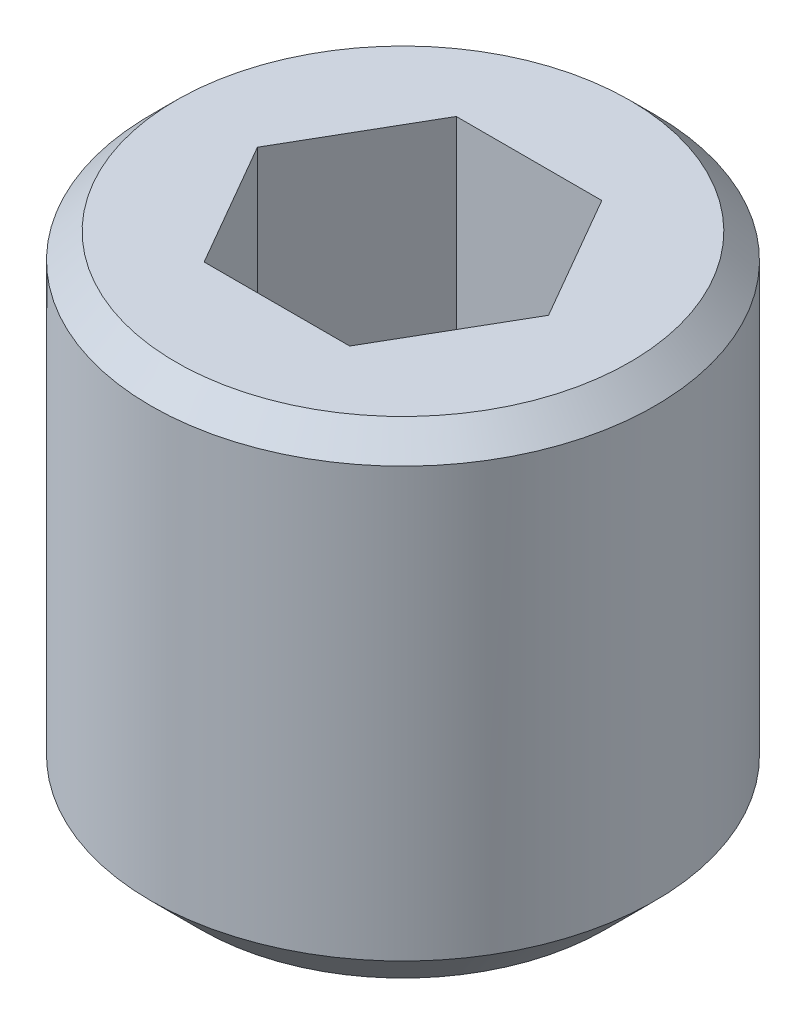
ISO-10303-21;
HEADER;
FILE_DESCRIPTION(('STEP AP214'),'2;1');
FILE_NAME('part.step','',(''),(''),'','','');
FILE_SCHEMA(('AUTOMOTIVE_DESIGN { 1 0 10303 214 1 1 1 1 }'));
ENDSEC;
DATA;
#1=APPLICATION_CONTEXT('core data for automotive mechanical design processes');
#2=APPLICATION_PROTOCOL_DEFINITION('international standard','automotive_design',2000,#1);
#3=PRODUCT_CONTEXT('',#1,'mechanical');
#4=PRODUCT('Part','Part','',(#3));
#5=PRODUCT_RELATED_PRODUCT_CATEGORY('part','',(#4));
#6=PRODUCT_DEFINITION_FORMATION('','',#4);
#7=PRODUCT_DEFINITION_CONTEXT('part definition',#1,'design');
#8=PRODUCT_DEFINITION('design','',#6,#7);
#9=PRODUCT_DEFINITION_SHAPE('','',#8);
#10=(LENGTH_UNIT() NAMED_UNIT(*) SI_UNIT(.MILLI.,.METRE.));
#11=(NAMED_UNIT(*) PLANE_ANGLE_UNIT() SI_UNIT($,.RADIAN.));
#12=(NAMED_UNIT(*) SI_UNIT($,.STERADIAN.) SOLID_ANGLE_UNIT());
#13=UNCERTAINTY_MEASURE_WITH_UNIT(LENGTH_MEASURE(1.E-05),#10,'distance_accuracy_value','');
#14=(GEOMETRIC_REPRESENTATION_CONTEXT(3) GLOBAL_UNCERTAINTY_ASSIGNED_CONTEXT((#13)) GLOBAL_UNIT_ASSIGNED_CONTEXT((#10,
#11,#12)) REPRESENTATION_CONTEXT('',''));
#15=CARTESIAN_POINT('',(0.,0.,0.));
#16=DIRECTION('',(0.,0.,1.));
#17=DIRECTION('',(1.,0.,0.));
#18=AXIS2_PLACEMENT_3D('',#15,#16,#17);
#19=CARTESIAN_POINT('',(0.,0.,0.));
#20=DIRECTION('',(0.,-1.,0.));
#21=DIRECTION('',(0.,0.,-1.));
#22=AXIS2_PLACEMENT_3D('',#19,#20,#21);
#23=PLANE('',#22);
#24=CARTESIAN_POINT('',(0.,0.,0.));
#25=DIRECTION('',(0.,-1.,0.));
#26=DIRECTION('',(0.,0.,-1.));
#27=AXIS2_PLACEMENT_3D('',#24,#25,#26);
#28=CIRCLE('',#27,1.35);
#29=CARTESIAN_POINT('',(0.,0.,-1.35));
#30=VERTEX_POINT('',#29);
#31=EDGE_CURVE('E46',#30,#30,#28,.F.);
#32=ORIENTED_EDGE('',*,*,#31,.T.);
#33=EDGE_LOOP('',(#32));
#34=FACE_BOUND('',#33,.T.);
#35=DIRECTION('',(-0.5,0.,0.866025403784439));
#36=VECTOR('',#35,1.);
#37=CARTESIAN_POINT('',(-0.43301270189222,0.,-0.75));
#38=LINE('',#37,#36);
#39=CARTESIAN_POINT('',(-0.43301270189222,0.,-0.75));
#40=VERTEX_POINT('',#39);
#41=CARTESIAN_POINT('',(-0.866025403784439,0.,0.));
#42=VERTEX_POINT('',#41);
#43=EDGE_CURVE('E127',#40,#42,#38,.T.);
#44=ORIENTED_EDGE('',*,*,#43,.F.);
#45=DIRECTION('',(-1.,0.,0.));
#46=VECTOR('',#45,1.);
#47=CARTESIAN_POINT('',(0.43301270189222,0.,-0.75));
#48=LINE('',#47,#46);
#49=CARTESIAN_POINT('',(0.43301270189222,0.,-0.75));
#50=VERTEX_POINT('',#49);
#51=EDGE_CURVE('E53',#50,#40,#48,.T.);
#52=ORIENTED_EDGE('',*,*,#51,.F.);
#53=DIRECTION('',(-0.5,0.,-0.866025403784439));
#54=VECTOR('',#53,1.);
#55=CARTESIAN_POINT('',(0.866025403784439,0.,0.));
#56=LINE('',#55,#54);
#57=CARTESIAN_POINT('',(0.866025403784439,0.,0.));
#58=VERTEX_POINT('',#57);
#59=EDGE_CURVE('E136',#58,#50,#56,.T.);
#60=ORIENTED_EDGE('',*,*,#59,.F.);
#61=DIRECTION('',(0.5,0.,-0.866025403784439));
#62=VECTOR('',#61,1.);
#63=CARTESIAN_POINT('',(0.43301270189222,0.,0.75));
#64=LINE('',#63,#62);
#65=CARTESIAN_POINT('',(0.43301270189222,0.,0.75));
#66=VERTEX_POINT('',#65);
#67=EDGE_CURVE('E134',#66,#58,#64,.T.);
#68=ORIENTED_EDGE('',*,*,#67,.F.);
#69=DIRECTION('',(1.,0.,0.));
#70=VECTOR('',#69,1.);
#71=CARTESIAN_POINT('',(-0.433012701892219,0.,0.750000000000001));
#72=LINE('',#71,#70);
#73=CARTESIAN_POINT('',(-0.433012701892219,0.,0.750000000000001));
#74=VERTEX_POINT('',#73);
#75=EDGE_CURVE('E101',#74,#66,#72,.T.);
#76=ORIENTED_EDGE('',*,*,#75,.F.);
#77=DIRECTION('',(0.5,0.,0.866025403784438));
#78=VECTOR('',#77,1.);
#79=CARTESIAN_POINT('',(-0.866025403784439,0.,0.));
#80=LINE('',#79,#78);
#81=EDGE_CURVE('E130',#42,#74,#80,.T.);
#82=ORIENTED_EDGE('',*,*,#81,.F.);
#83=EDGE_LOOP('',(#44,#52,#60,#68,#76,#82));
#84=FACE_BOUND('',#83,.T.);
#85=ADVANCED_FACE('F38',(#34,#84),#23,.F.);
#86=CARTESIAN_POINT('',(0.,0.,0.));
#87=DIRECTION('',(0.,1.,0.));
#88=DIRECTION('',(0.,0.,1.));
#89=AXIS2_PLACEMENT_3D('',#86,#87,#88);
#90=CYLINDRICAL_SURFACE('',#89,1.5);
#91=CARTESIAN_POINT('',(0.,-0.150000000000001,0.));
#92=DIRECTION('',(0.,-1.,0.));
#93=DIRECTION('',(0.,0.,-1.));
#94=AXIS2_PLACEMENT_3D('',#91,#92,#93);
#95=CIRCLE('',#94,1.5);
#96=CARTESIAN_POINT('',(0.,-0.150000000000001,-1.5));
#97=VERTEX_POINT('',#96);
#98=EDGE_CURVE('E11',#97,#97,#95,.T.);
#99=ORIENTED_EDGE('',*,*,#98,.T.);
#100=EDGE_LOOP('',(#99));
#101=FACE_BOUND('',#100,.T.);
#102=CARTESIAN_POINT('',(0.,-2.7,0.));
#103=DIRECTION('',(0.,1.,0.));
#104=DIRECTION('',(0.,0.,1.));
#105=AXIS2_PLACEMENT_3D('',#102,#103,#104);
#106=CIRCLE('',#105,1.5);
#107=CARTESIAN_POINT('',(0.,-2.7,1.5));
#108=VERTEX_POINT('',#107);
#109=EDGE_CURVE('E140',#108,#108,#106,.T.);
#110=ORIENTED_EDGE('',*,*,#109,.T.);
#111=EDGE_LOOP('',(#110));
#112=FACE_BOUND('',#111,.T.);
#113=ADVANCED_FACE('F164',(#101,#112),#90,.T.);
#114=CARTESIAN_POINT('',(1.5,-3.,0.));
#115=DIRECTION('',(0.,1.,0.));
#116=DIRECTION('',(0.,0.,1.));
#117=AXIS2_PLACEMENT_3D('',#114,#115,#116);
#118=PLANE('',#117);
#119=CARTESIAN_POINT('',(0.,-3.,0.));
#120=DIRECTION('',(0.,1.,0.));
#121=DIRECTION('',(0.,0.,1.));
#122=AXIS2_PLACEMENT_3D('',#119,#120,#121);
#123=CIRCLE('',#122,1.2);
#124=CARTESIAN_POINT('',(0.,-3.,1.2));
#125=VERTEX_POINT('',#124);
#126=EDGE_CURVE('E148',#125,#125,#123,.F.);
#127=ORIENTED_EDGE('',*,*,#126,.T.);
#128=EDGE_LOOP('',(#127));
#129=FACE_BOUND('',#128,.T.);
#130=ADVANCED_FACE('F169',(#129),#118,.F.);
#131=CARTESIAN_POINT('',(0.43301270189222,-1.5,-0.75));
#132=DIRECTION('',(0.,0.,-1.));
#133=DIRECTION('',(-1.,0.,0.));
#134=AXIS2_PLACEMENT_3D('',#131,#132,#133);
#135=PLANE('',#134);
#136=ORIENTED_EDGE('',*,*,#51,.T.);
#137=DIRECTION('',(0.,1.,0.));
#138=VECTOR('',#137,1.);
#139=CARTESIAN_POINT('',(-0.43301270189222,-1.5,-0.75));
#140=LINE('',#139,#138);
#141=CARTESIAN_POINT('',(-0.43301270189222,-1.5,-0.75));
#142=VERTEX_POINT('',#141);
#143=EDGE_CURVE('E83',#142,#40,#140,.T.);
#144=ORIENTED_EDGE('',*,*,#143,.F.);
#145=DIRECTION('',(-1.,0.,0.));
#146=VECTOR('',#145,1.);
#147=CARTESIAN_POINT('',(0.43301270189222,-1.5,-0.75));
#148=LINE('',#147,#146);
#149=CARTESIAN_POINT('',(0.43301270189222,-1.5,-0.75));
#150=VERTEX_POINT('',#149);
#151=EDGE_CURVE('E138',#150,#142,#148,.T.);
#152=ORIENTED_EDGE('',*,*,#151,.F.);
#153=DIRECTION('',(0.,1.,0.));
#154=VECTOR('',#153,1.);
#155=CARTESIAN_POINT('',(0.43301270189222,-1.5,-0.75));
#156=LINE('',#155,#154);
#157=EDGE_CURVE('E61',#150,#50,#156,.T.);
#158=ORIENTED_EDGE('',*,*,#157,.T.);
#159=EDGE_LOOP('',(#136,#144,#152,#158));
#160=FACE_BOUND('',#159,.T.);
#161=ADVANCED_FACE('F175',(#160),#135,.F.);
#162=CARTESIAN_POINT('',(0.866025403784439,-1.5,0.));
#163=DIRECTION('',(0.866025403784439,0.,-0.5));
#164=DIRECTION('',(-0.5,0.,-0.866025403784439));
#165=AXIS2_PLACEMENT_3D('',#162,#163,#164);
#166=PLANE('',#165);
#167=ORIENTED_EDGE('',*,*,#59,.T.);
#168=ORIENTED_EDGE('',*,*,#157,.F.);
#169=DIRECTION('',(-0.5,0.,-0.866025403784439));
#170=VECTOR('',#169,1.);
#171=CARTESIAN_POINT('',(0.866025403784439,-1.5,0.));
#172=LINE('',#171,#170);
#173=CARTESIAN_POINT('',(0.866025403784439,-1.5,0.));
#174=VERTEX_POINT('',#173);
#175=EDGE_CURVE('E113',#174,#150,#172,.T.);
#176=ORIENTED_EDGE('',*,*,#175,.F.);
#177=DIRECTION('',(0.,1.,0.));
#178=VECTOR('',#177,1.);
#179=CARTESIAN_POINT('',(0.866025403784439,-1.5,0.));
#180=LINE('',#179,#178);
#181=EDGE_CURVE('E105',#174,#58,#180,.T.);
#182=ORIENTED_EDGE('',*,*,#181,.T.);
#183=EDGE_LOOP('',(#167,#168,#176,#182));
#184=FACE_BOUND('',#183,.T.);
#185=ADVANCED_FACE('F179',(#184),#166,.F.);
#186=CARTESIAN_POINT('',(0.43301270189222,-1.5,0.75));
#187=DIRECTION('',(0.866025403784439,0.,0.5));
#188=DIRECTION('',(0.5,0.,-0.866025403784439));
#189=AXIS2_PLACEMENT_3D('',#186,#187,#188);
#190=PLANE('',#189);
#191=ORIENTED_EDGE('',*,*,#67,.T.);
#192=ORIENTED_EDGE('',*,*,#181,.F.);
#193=DIRECTION('',(0.5,0.,-0.866025403784439));
#194=VECTOR('',#193,1.);
#195=CARTESIAN_POINT('',(0.43301270189222,-1.5,0.75));
#196=LINE('',#195,#194);
#197=CARTESIAN_POINT('',(0.43301270189222,-1.5,0.75));
#198=VERTEX_POINT('',#197);
#199=EDGE_CURVE('E109',#198,#174,#196,.T.);
#200=ORIENTED_EDGE('',*,*,#199,.F.);
#201=DIRECTION('',(0.,1.,0.));
#202=VECTOR('',#201,1.);
#203=CARTESIAN_POINT('',(0.43301270189222,-1.5,0.75));
#204=LINE('',#203,#202);
#205=EDGE_CURVE('E94',#198,#66,#204,.T.);
#206=ORIENTED_EDGE('',*,*,#205,.T.);
#207=EDGE_LOOP('',(#191,#192,#200,#206));
#208=FACE_BOUND('',#207,.T.);
#209=ADVANCED_FACE('F110',(#208),#190,.F.);
#210=CARTESIAN_POINT('',(-0.433012701892219,-1.5,0.750000000000001));
#211=DIRECTION('',(0.,0.,1.));
#212=DIRECTION('',(1.,0.,0.));
#213=AXIS2_PLACEMENT_3D('',#210,#211,#212);
#214=PLANE('',#213);
#215=ORIENTED_EDGE('',*,*,#75,.T.);
#216=ORIENTED_EDGE('',*,*,#205,.F.);
#217=DIRECTION('',(1.,0.,0.));
#218=VECTOR('',#217,1.);
#219=CARTESIAN_POINT('',(-0.433012701892219,-1.5,0.750000000000001));
#220=LINE('',#219,#218);
#221=CARTESIAN_POINT('',(-0.433012701892219,-1.5,0.750000000000001));
#222=VERTEX_POINT('',#221);
#223=EDGE_CURVE('E98',#222,#198,#220,.T.);
#224=ORIENTED_EDGE('',*,*,#223,.F.);
#225=DIRECTION('',(0.,1.,0.));
#226=VECTOR('',#225,1.);
#227=CARTESIAN_POINT('',(-0.433012701892219,-1.5,0.750000000000001));
#228=LINE('',#227,#226);
#229=EDGE_CURVE('E106',#222,#74,#228,.T.);
#230=ORIENTED_EDGE('',*,*,#229,.T.);
#231=EDGE_LOOP('',(#215,#216,#224,#230));
#232=FACE_BOUND('',#231,.T.);
#233=ADVANCED_FACE('F96',(#232),#214,.F.);
#234=CARTESIAN_POINT('',(-0.866025403784439,-1.5,0.));
#235=DIRECTION('',(-0.866025403784438,0.,0.5));
#236=DIRECTION('',(0.5,0.,0.866025403784438));
#237=AXIS2_PLACEMENT_3D('',#234,#235,#236);
#238=PLANE('',#237);
#239=ORIENTED_EDGE('',*,*,#81,.T.);
#240=ORIENTED_EDGE('',*,*,#229,.F.);
#241=DIRECTION('',(0.5,0.,0.866025403784438));
#242=VECTOR('',#241,1.);
#243=CARTESIAN_POINT('',(-0.866025403784439,-1.5,0.));
#244=LINE('',#243,#242);
#245=CARTESIAN_POINT('',(-0.866025403784439,-1.5,0.));
#246=VERTEX_POINT('',#245);
#247=EDGE_CURVE('E119',#246,#222,#244,.T.);
#248=ORIENTED_EDGE('',*,*,#247,.F.);
#249=DIRECTION('',(0.,1.,0.));
#250=VECTOR('',#249,1.);
#251=CARTESIAN_POINT('',(-0.866025403784439,-1.5,0.));
#252=LINE('',#251,#250);
#253=EDGE_CURVE('E143',#246,#42,#252,.T.);
#254=ORIENTED_EDGE('',*,*,#253,.T.);
#255=EDGE_LOOP('',(#239,#240,#248,#254));
#256=FACE_BOUND('',#255,.T.);
#257=ADVANCED_FACE('F183',(#256),#238,.F.);
#258=CARTESIAN_POINT('',(-0.43301270189222,-1.5,-0.75));
#259=DIRECTION('',(-0.866025403784439,0.,-0.5));
#260=DIRECTION('',(-0.5,0.,0.866025403784439));
#261=AXIS2_PLACEMENT_3D('',#258,#259,#260);
#262=PLANE('',#261);
#263=ORIENTED_EDGE('',*,*,#43,.T.);
#264=ORIENTED_EDGE('',*,*,#253,.F.);
#265=DIRECTION('',(-0.5,0.,0.866025403784439));
#266=VECTOR('',#265,1.);
#267=CARTESIAN_POINT('',(-0.43301270189222,-1.5,-0.75));
#268=LINE('',#267,#266);
#269=EDGE_CURVE('E121',#142,#246,#268,.T.);
#270=ORIENTED_EDGE('',*,*,#269,.F.);
#271=ORIENTED_EDGE('',*,*,#143,.T.);
#272=EDGE_LOOP('',(#263,#264,#270,#271));
#273=FACE_BOUND('',#272,.T.);
#274=ADVANCED_FACE('F180',(#273),#262,.F.);
#275=CARTESIAN_POINT('',(-0.43301270189222,-1.5,-0.75));
#276=DIRECTION('',(0.,1.,0.));
#277=DIRECTION('',(0.,0.,1.));
#278=AXIS2_PLACEMENT_3D('',#275,#276,#277);
#279=PLANE('',#278);
#280=ORIENTED_EDGE('',*,*,#151,.T.);
#281=ORIENTED_EDGE('',*,*,#269,.T.);
#282=ORIENTED_EDGE('',*,*,#247,.T.);
#283=ORIENTED_EDGE('',*,*,#223,.T.);
#284=ORIENTED_EDGE('',*,*,#199,.T.);
#285=ORIENTED_EDGE('',*,*,#175,.T.);
#286=EDGE_LOOP('',(#280,#281,#282,#283,#284,#285));
#287=FACE_BOUND('',#286,.T.);
#288=ADVANCED_FACE('F116',(#287),#279,.T.);
#289=CARTESIAN_POINT('',(0.,-2.7,0.));
#290=DIRECTION('',(0.,1.,0.));
#291=DIRECTION('',(0.,0.,1.));
#292=AXIS2_PLACEMENT_3D('',#289,#290,#291);
#293=CONICAL_SURFACE('',#292,1.5,0.78539816339745);
#294=ORIENTED_EDGE('',*,*,#126,.F.);
#295=EDGE_LOOP('',(#294));
#296=FACE_BOUND('',#295,.T.);
#297=ORIENTED_EDGE('',*,*,#109,.F.);
#298=EDGE_LOOP('',(#297));
#299=FACE_BOUND('',#298,.T.);
#300=ADVANCED_FACE('F156',(#296,#299),#293,.T.);
#301=CARTESIAN_POINT('',(0.,0.,0.));
#302=DIRECTION('',(0.,-1.,0.));
#303=DIRECTION('',(0.,0.,-1.));
#304=AXIS2_PLACEMENT_3D('',#301,#302,#303);
#305=CONICAL_SURFACE('',#304,1.35,0.785398163397448);
#306=ORIENTED_EDGE('',*,*,#98,.F.);
#307=EDGE_LOOP('',(#306));
#308=FACE_BOUND('',#307,.T.);
#309=ORIENTED_EDGE('',*,*,#31,.F.);
#310=EDGE_LOOP('',(#309));
#311=FACE_BOUND('',#310,.T.);
#312=ADVANCED_FACE('F40',(#308,#311),#305,.T.);
#313=CLOSED_SHELL('',(#85,#113,#130,#161,#185,#209,#233,#257,#274,#288,#300,#312));
#314=MANIFOLD_SOLID_BREP('B2',#313);
#315=ADVANCED_BREP_SHAPE_REPRESENTATION('',(#18,#314),#14);
#316=SHAPE_DEFINITION_REPRESENTATION(#9,#315);
ENDSEC;
END-ISO-10303-21;
